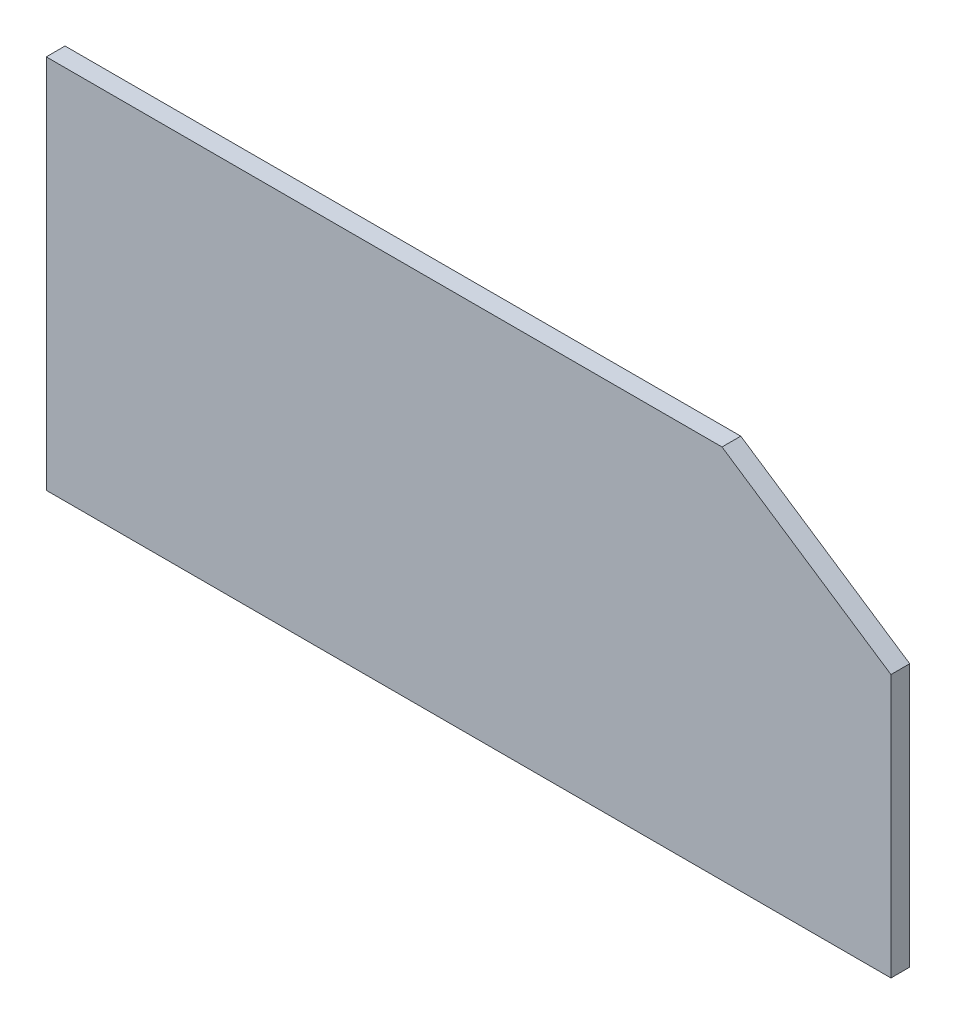
ISO-10303-21;
HEADER;
FILE_DESCRIPTION(('STEP AP214'),'2;1');
FILE_NAME('part.step','',(''),(''),'','','');
FILE_SCHEMA(('AUTOMOTIVE_DESIGN { 1 0 10303 214 1 1 1 1 }'));
ENDSEC;
DATA;
#1=APPLICATION_CONTEXT('core data for automotive mechanical design processes');
#2=APPLICATION_PROTOCOL_DEFINITION('international standard','automotive_design',2000,#1);
#3=PRODUCT_CONTEXT('',#1,'mechanical');
#4=PRODUCT('Part','Part','',(#3));
#5=PRODUCT_RELATED_PRODUCT_CATEGORY('part','',(#4));
#6=PRODUCT_DEFINITION_FORMATION('','',#4);
#7=PRODUCT_DEFINITION_CONTEXT('part definition',#1,'design');
#8=PRODUCT_DEFINITION('design','',#6,#7);
#9=PRODUCT_DEFINITION_SHAPE('','',#8);
#10=(LENGTH_UNIT() NAMED_UNIT(*) SI_UNIT(.MILLI.,.METRE.));
#11=(NAMED_UNIT(*) PLANE_ANGLE_UNIT() SI_UNIT($,.RADIAN.));
#12=(NAMED_UNIT(*) SI_UNIT($,.STERADIAN.) SOLID_ANGLE_UNIT());
#13=UNCERTAINTY_MEASURE_WITH_UNIT(LENGTH_MEASURE(1.E-05),#10,'distance_accuracy_value','');
#14=(GEOMETRIC_REPRESENTATION_CONTEXT(3) GLOBAL_UNCERTAINTY_ASSIGNED_CONTEXT((#13)) GLOBAL_UNIT_ASSIGNED_CONTEXT((#10,
#11,#12)) REPRESENTATION_CONTEXT('',''));
#15=CARTESIAN_POINT('',(0.,0.,0.));
#16=DIRECTION('',(0.,0.,1.));
#17=DIRECTION('',(1.,0.,0.));
#18=AXIS2_PLACEMENT_3D('',#15,#16,#17);
#19=CARTESIAN_POINT('',(-150.01192850476,-53.8034469641098,1.5875));
#20=DIRECTION('',(1.,0.,0.));
#21=DIRECTION('',(0.,0.,-1.));
#22=AXIS2_PLACEMENT_3D('',#19,#20,#21);
#23=PLANE('',#22);
#24=DIRECTION('',(0.,-1.,0.));
#25=VECTOR('',#24,1.);
#26=CARTESIAN_POINT('',(-150.01192850476,-53.8034469641098,-1.5875));
#27=LINE('',#26,#25);
#28=CARTESIAN_POINT('',(-150.01192850476,-53.8034469641098,-1.5875));
#29=VERTEX_POINT('',#28);
#30=CARTESIAN_POINT('',(-150.01192850476,-117.30344696411,-1.5875));
#31=VERTEX_POINT('',#30);
#32=EDGE_CURVE('E108',#29,#31,#27,.T.);
#33=ORIENTED_EDGE('',*,*,#32,.T.);
#34=DIRECTION('',(0.,0.,-1.));
#35=VECTOR('',#34,1.);
#36=CARTESIAN_POINT('',(-150.01192850476,-117.30344696411,1.5875));
#37=LINE('',#36,#35);
#38=CARTESIAN_POINT('',(-150.01192850476,-117.30344696411,1.5875));
#39=VERTEX_POINT('',#38);
#40=EDGE_CURVE('E11',#39,#31,#37,.T.);
#41=ORIENTED_EDGE('',*,*,#40,.F.);
#42=DIRECTION('',(0.,-1.,0.));
#43=VECTOR('',#42,1.);
#44=CARTESIAN_POINT('',(-150.01192850476,-53.8034469641098,1.5875));
#45=LINE('',#44,#43);
#46=CARTESIAN_POINT('',(-150.01192850476,-53.8034469641098,1.5875));
#47=VERTEX_POINT('',#46);
#48=EDGE_CURVE('E116',#47,#39,#45,.T.);
#49=ORIENTED_EDGE('',*,*,#48,.F.);
#50=DIRECTION('',(0.,0.,-1.));
#51=VECTOR('',#50,1.);
#52=CARTESIAN_POINT('',(-150.01192850476,-53.8034469641098,1.5875));
#53=LINE('',#52,#51);
#54=EDGE_CURVE('E104',#47,#29,#53,.T.);
#55=ORIENTED_EDGE('',*,*,#54,.T.);
#56=EDGE_LOOP('',(#33,#41,#49,#55));
#57=FACE_BOUND('',#56,.T.);
#58=ADVANCED_FACE('F34',(#57),#23,.F.);
#59=CARTESIAN_POINT('',(-150.01192850476,-117.30344696411,1.5875));
#60=DIRECTION('',(0.,1.,0.));
#61=DIRECTION('',(0.,0.,1.));
#62=AXIS2_PLACEMENT_3D('',#59,#60,#61);
#63=PLANE('',#62);
#64=DIRECTION('',(1.,0.,0.));
#65=VECTOR('',#64,1.);
#66=CARTESIAN_POINT('',(-150.01192850476,-117.30344696411,-1.5875));
#67=LINE('',#66,#65);
#68=CARTESIAN_POINT('',(-7.13692850476023,-117.30344696411,-1.5875));
#69=VERTEX_POINT('',#68);
#70=EDGE_CURVE('E111',#31,#69,#67,.T.);
#71=ORIENTED_EDGE('',*,*,#70,.T.);
#72=DIRECTION('',(0.,0.,-1.));
#73=VECTOR('',#72,1.);
#74=CARTESIAN_POINT('',(-7.13692850476023,-117.30344696411,1.5875));
#75=LINE('',#74,#73);
#76=CARTESIAN_POINT('',(-7.13692850476023,-117.30344696411,1.5875));
#77=VERTEX_POINT('',#76);
#78=EDGE_CURVE('E42',#77,#69,#75,.T.);
#79=ORIENTED_EDGE('',*,*,#78,.F.);
#80=DIRECTION('',(1.,0.,0.));
#81=VECTOR('',#80,1.);
#82=CARTESIAN_POINT('',(-150.01192850476,-117.30344696411,1.5875));
#83=LINE('',#82,#81);
#84=EDGE_CURVE('E84',#39,#77,#83,.T.);
#85=ORIENTED_EDGE('',*,*,#84,.F.);
#86=ORIENTED_EDGE('',*,*,#40,.T.);
#87=EDGE_LOOP('',(#71,#79,#85,#86));
#88=FACE_BOUND('',#87,.T.);
#89=ADVANCED_FACE('F135',(#88),#63,.F.);
#90=CARTESIAN_POINT('',(-7.13692850476023,-117.30344696411,1.5875));
#91=DIRECTION('',(-1.,0.,0.));
#92=DIRECTION('',(0.,0.,1.));
#93=AXIS2_PLACEMENT_3D('',#90,#91,#92);
#94=PLANE('',#93);
#95=DIRECTION('',(0.,1.,0.));
#96=VECTOR('',#95,1.);
#97=CARTESIAN_POINT('',(-7.13692850476023,-117.30344696411,-1.5875));
#98=LINE('',#97,#96);
#99=CARTESIAN_POINT('',(-7.13692850476023,-72.8534469641098,-1.5875));
#100=VERTEX_POINT('',#99);
#101=EDGE_CURVE('E99',#69,#100,#98,.T.);
#102=ORIENTED_EDGE('',*,*,#101,.T.);
#103=DIRECTION('',(0.,0.,-1.));
#104=VECTOR('',#103,1.);
#105=CARTESIAN_POINT('',(-7.13692850476023,-72.8534469641098,1.5875));
#106=LINE('',#105,#104);
#107=CARTESIAN_POINT('',(-7.13692850476023,-72.8534469641098,1.5875));
#108=VERTEX_POINT('',#107);
#109=EDGE_CURVE('E96',#108,#100,#106,.T.);
#110=ORIENTED_EDGE('',*,*,#109,.F.);
#111=DIRECTION('',(0.,1.,0.));
#112=VECTOR('',#111,1.);
#113=CARTESIAN_POINT('',(-7.13692850476023,-117.30344696411,1.5875));
#114=LINE('',#113,#112);
#115=EDGE_CURVE('E88',#77,#108,#114,.T.);
#116=ORIENTED_EDGE('',*,*,#115,.F.);
#117=ORIENTED_EDGE('',*,*,#78,.T.);
#118=EDGE_LOOP('',(#102,#110,#116,#117));
#119=FACE_BOUND('',#118,.T.);
#120=ADVANCED_FACE('F97',(#119),#94,.F.);
#121=CARTESIAN_POINT('',(-7.13692850476023,-72.8534469641098,1.5875));
#122=DIRECTION('',(-0.554700196225228,-0.832050294337844,0.));
#123=DIRECTION('',(0.832050294337844,-0.554700196225228,0.));
#124=AXIS2_PLACEMENT_3D('',#121,#122,#123);
#125=PLANE('',#124);
#126=DIRECTION('',(-0.832050294337844,0.554700196225228,0.));
#127=VECTOR('',#126,1.);
#128=CARTESIAN_POINT('',(-7.13692850476023,-72.8534469641098,-1.5875));
#129=LINE('',#128,#127);
#130=CARTESIAN_POINT('',(-35.7119285047603,-53.8034469641098,-1.5875));
#131=VERTEX_POINT('',#130);
#132=EDGE_CURVE('E70',#100,#131,#129,.T.);
#133=ORIENTED_EDGE('',*,*,#132,.T.);
#134=DIRECTION('',(0.,0.,-1.));
#135=VECTOR('',#134,1.);
#136=CARTESIAN_POINT('',(-35.7119285047603,-53.8034469641098,1.5875));
#137=LINE('',#136,#135);
#138=CARTESIAN_POINT('',(-35.7119285047603,-53.8034469641098,1.5875));
#139=VERTEX_POINT('',#138);
#140=EDGE_CURVE('E100',#139,#131,#137,.T.);
#141=ORIENTED_EDGE('',*,*,#140,.F.);
#142=DIRECTION('',(-0.832050294337844,0.554700196225228,0.));
#143=VECTOR('',#142,1.);
#144=CARTESIAN_POINT('',(-7.13692850476023,-72.8534469641098,1.5875));
#145=LINE('',#144,#143);
#146=EDGE_CURVE('E92',#108,#139,#145,.T.);
#147=ORIENTED_EDGE('',*,*,#146,.F.);
#148=ORIENTED_EDGE('',*,*,#109,.T.);
#149=EDGE_LOOP('',(#133,#141,#147,#148));
#150=FACE_BOUND('',#149,.T.);
#151=ADVANCED_FACE('F102',(#150),#125,.F.);
#152=CARTESIAN_POINT('',(-35.7119285047603,-53.8034469641098,1.5875));
#153=DIRECTION('',(0.,-1.,0.));
#154=DIRECTION('',(0.,0.,-1.));
#155=AXIS2_PLACEMENT_3D('',#152,#153,#154);
#156=PLANE('',#155);
#157=DIRECTION('',(-1.,0.,0.));
#158=VECTOR('',#157,1.);
#159=CARTESIAN_POINT('',(-35.7119285047603,-53.8034469641098,-1.5875));
#160=LINE('',#159,#158);
#161=EDGE_CURVE('E76',#131,#29,#160,.T.);
#162=ORIENTED_EDGE('',*,*,#161,.T.);
#163=ORIENTED_EDGE('',*,*,#54,.F.);
#164=DIRECTION('',(-1.,0.,0.));
#165=VECTOR('',#164,1.);
#166=CARTESIAN_POINT('',(-35.7119285047603,-53.8034469641098,1.5875));
#167=LINE('',#166,#165);
#168=EDGE_CURVE('E50',#139,#47,#167,.T.);
#169=ORIENTED_EDGE('',*,*,#168,.F.);
#170=ORIENTED_EDGE('',*,*,#140,.T.);
#171=EDGE_LOOP('',(#162,#163,#169,#170));
#172=FACE_BOUND('',#171,.T.);
#173=ADVANCED_FACE('F124',(#172),#156,.F.);
#174=CARTESIAN_POINT('',(0.,0.,1.5875));
#175=DIRECTION('',(0.,0.,1.));
#176=DIRECTION('',(1.,0.,0.));
#177=AXIS2_PLACEMENT_3D('',#174,#175,#176);
#178=PLANE('',#177);
#179=ORIENTED_EDGE('',*,*,#48,.T.);
#180=ORIENTED_EDGE('',*,*,#84,.T.);
#181=ORIENTED_EDGE('',*,*,#115,.T.);
#182=ORIENTED_EDGE('',*,*,#146,.T.);
#183=ORIENTED_EDGE('',*,*,#168,.T.);
#184=EDGE_LOOP('',(#179,#180,#181,#182,#183));
#185=FACE_BOUND('',#184,.T.);
#186=ADVANCED_FACE('F90',(#185),#178,.T.);
#187=CARTESIAN_POINT('',(0.,0.,-1.5875));
#188=DIRECTION('',(0.,0.,1.));
#189=DIRECTION('',(1.,0.,0.));
#190=AXIS2_PLACEMENT_3D('',#187,#188,#189);
#191=PLANE('',#190);
#192=ORIENTED_EDGE('',*,*,#32,.F.);
#193=ORIENTED_EDGE('',*,*,#161,.F.);
#194=ORIENTED_EDGE('',*,*,#132,.F.);
#195=ORIENTED_EDGE('',*,*,#101,.F.);
#196=ORIENTED_EDGE('',*,*,#70,.F.);
#197=EDGE_LOOP('',(#192,#193,#194,#195,#196));
#198=FACE_BOUND('',#197,.T.);
#199=ADVANCED_FACE('F120',(#198),#191,.F.);
#200=CLOSED_SHELL('',(#58,#89,#120,#151,#173,#186,#199));
#201=MANIFOLD_SOLID_BREP('B2',#200);
#202=ADVANCED_BREP_SHAPE_REPRESENTATION('',(#18,#201),#14);
#203=SHAPE_DEFINITION_REPRESENTATION(#9,#202);
ENDSEC;
END-ISO-10303-21;
